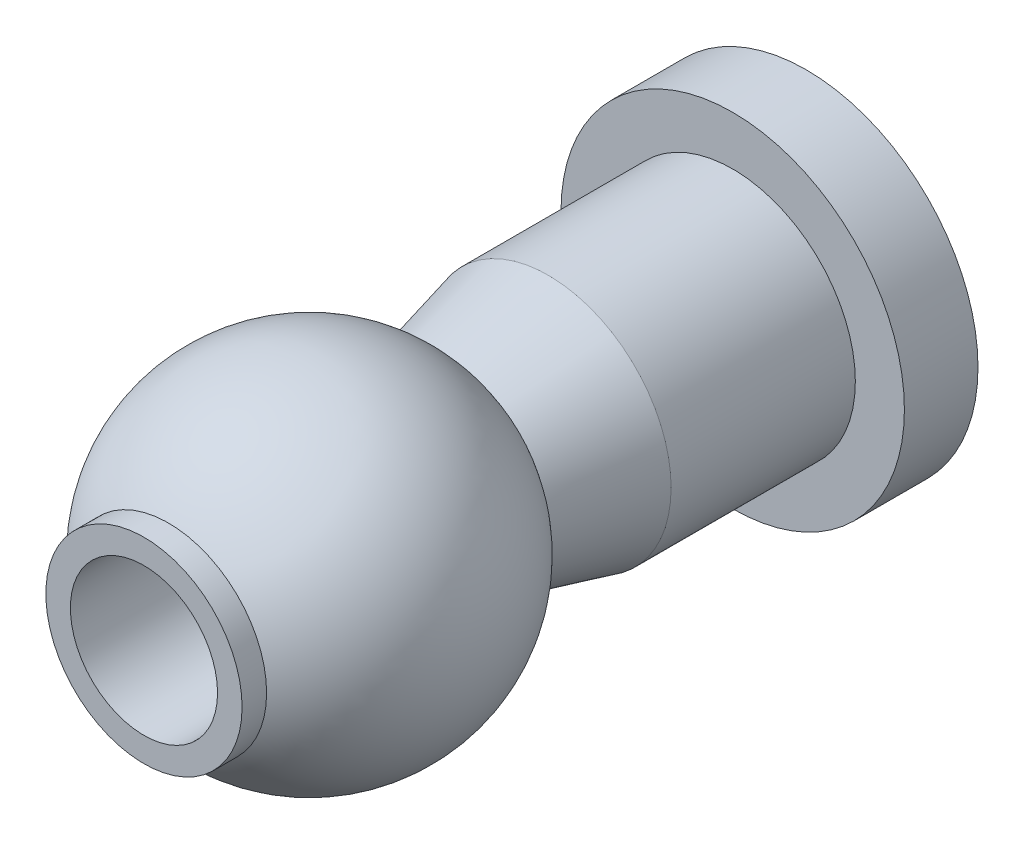
ISO-10303-21;
HEADER;
FILE_DESCRIPTION(('STEP AP214'),'2;1');
FILE_NAME('part.step','',(''),(''),'','','');
FILE_SCHEMA(('AUTOMOTIVE_DESIGN { 1 0 10303 214 1 1 1 1 }'));
ENDSEC;
DATA;
#1=APPLICATION_CONTEXT('core data for automotive mechanical design processes');
#2=APPLICATION_PROTOCOL_DEFINITION('international standard','automotive_design',2000,#1);
#3=PRODUCT_CONTEXT('',#1,'mechanical');
#4=PRODUCT('Part','Part','',(#3));
#5=PRODUCT_RELATED_PRODUCT_CATEGORY('part','',(#4));
#6=PRODUCT_DEFINITION_FORMATION('','',#4);
#7=PRODUCT_DEFINITION_CONTEXT('part definition',#1,'design');
#8=PRODUCT_DEFINITION('design','',#6,#7);
#9=PRODUCT_DEFINITION_SHAPE('','',#8);
#10=(LENGTH_UNIT() NAMED_UNIT(*) SI_UNIT(.MILLI.,.METRE.));
#11=(NAMED_UNIT(*) PLANE_ANGLE_UNIT() SI_UNIT($,.RADIAN.));
#12=(NAMED_UNIT(*) SI_UNIT($,.STERADIAN.) SOLID_ANGLE_UNIT());
#13=UNCERTAINTY_MEASURE_WITH_UNIT(LENGTH_MEASURE(1.E-05),#10,'distance_accuracy_value','');
#14=(GEOMETRIC_REPRESENTATION_CONTEXT(3) GLOBAL_UNCERTAINTY_ASSIGNED_CONTEXT((#13)) GLOBAL_UNIT_ASSIGNED_CONTEXT((#10,
#11,#12)) REPRESENTATION_CONTEXT('',''));
#15=CARTESIAN_POINT('',(0.,0.,0.));
#16=DIRECTION('',(0.,0.,1.));
#17=DIRECTION('',(1.,0.,0.));
#18=AXIS2_PLACEMENT_3D('',#15,#16,#17);
#19=CARTESIAN_POINT('',(0.,0.,-3.37228132326901));
#20=DIRECTION('',(0.,0.,1.));
#21=DIRECTION('',(0.,1.,0.));
#22=AXIS2_PLACEMENT_3D('',#19,#20,#21);
#23=SPHERICAL_SURFACE('',#22,3.5);
#24=CARTESIAN_POINT('',(0.,0.,-0.5));
#25=DIRECTION('',(0.,0.,1.));
#26=DIRECTION('',(1.,0.,0.));
#27=AXIS2_PLACEMENT_3D('',#24,#25,#26);
#28=CIRCLE('',#27,2.);
#29=CARTESIAN_POINT('',(2.,0.,-0.5));
#30=VERTEX_POINT('',#29);
#31=EDGE_CURVE('E10',#30,#30,#28,.T.);
#32=ORIENTED_EDGE('',*,*,#31,.F.);
#33=EDGE_LOOP('',(#32));
#34=FACE_BOUND('',#33,.T.);
#35=CARTESIAN_POINT('',(0.,0.,-6.24456264653803));
#36=DIRECTION('',(0.,0.,1.));
#37=DIRECTION('',(1.,0.,0.));
#38=AXIS2_PLACEMENT_3D('',#35,#36,#37);
#39=CIRCLE('',#38,2.);
#40=CARTESIAN_POINT('',(2.,0.,-6.24456264653803));
#41=VERTEX_POINT('',#40);
#42=EDGE_CURVE('E61',#41,#41,#39,.T.);
#43=ORIENTED_EDGE('',*,*,#42,.T.);
#44=EDGE_LOOP('',(#43));
#45=FACE_BOUND('',#44,.T.);
#46=ADVANCED_FACE('F30',(#34,#45),#23,.T.);
#47=CARTESIAN_POINT('',(0.,0.,0.));
#48=DIRECTION('',(0.,0.,1.));
#49=DIRECTION('',(1.,0.,0.));
#50=AXIS2_PLACEMENT_3D('',#47,#48,#49);
#51=CYLINDRICAL_SURFACE('',#50,2.);
#52=CARTESIAN_POINT('',(0.,0.,0.));
#53=DIRECTION('',(0.,0.,1.));
#54=DIRECTION('',(1.,0.,0.));
#55=AXIS2_PLACEMENT_3D('',#52,#53,#54);
#56=CIRCLE('',#55,2.);
#57=CARTESIAN_POINT('',(2.,0.,0.));
#58=VERTEX_POINT('',#57);
#59=EDGE_CURVE('E36',#58,#58,#56,.T.);
#60=ORIENTED_EDGE('',*,*,#59,.F.);
#61=EDGE_LOOP('',(#60));
#62=FACE_BOUND('',#61,.T.);
#63=ORIENTED_EDGE('',*,*,#31,.T.);
#64=EDGE_LOOP('',(#63));
#65=FACE_BOUND('',#64,.T.);
#66=ADVANCED_FACE('F104',(#62,#65),#51,.T.);
#67=CARTESIAN_POINT('',(0.,1.5,0.));
#68=DIRECTION('',(0.,0.,-1.));
#69=DIRECTION('',(-1.,0.,0.));
#70=AXIS2_PLACEMENT_3D('',#67,#68,#69);
#71=PLANE('',#70);
#72=CARTESIAN_POINT('',(0.,0.,0.));
#73=DIRECTION('',(0.,0.,1.));
#74=DIRECTION('',(1.,0.,0.));
#75=AXIS2_PLACEMENT_3D('',#72,#73,#74);
#76=CIRCLE('',#75,1.5);
#77=CARTESIAN_POINT('',(1.5,0.,0.));
#78=VERTEX_POINT('',#77);
#79=EDGE_CURVE('E40',#78,#78,#76,.T.);
#80=ORIENTED_EDGE('',*,*,#79,.F.);
#81=EDGE_LOOP('',(#80));
#82=FACE_BOUND('',#81,.T.);
#83=ORIENTED_EDGE('',*,*,#59,.T.);
#84=EDGE_LOOP('',(#83));
#85=FACE_BOUND('',#84,.T.);
#86=ADVANCED_FACE('F99',(#82,#85),#71,.F.);
#87=CARTESIAN_POINT('',(0.,0.,0.));
#88=DIRECTION('',(0.,0.,1.));
#89=DIRECTION('',(1.,0.,0.));
#90=AXIS2_PLACEMENT_3D('',#87,#88,#89);
#91=CYLINDRICAL_SURFACE('',#90,1.5);
#92=CARTESIAN_POINT('',(0.,0.,-13.5));
#93=DIRECTION('',(0.,0.,1.));
#94=DIRECTION('',(1.,0.,0.));
#95=AXIS2_PLACEMENT_3D('',#92,#93,#94);
#96=CIRCLE('',#95,1.5);
#97=CARTESIAN_POINT('',(1.5,0.,-13.5));
#98=VERTEX_POINT('',#97);
#99=EDGE_CURVE('E44',#98,#98,#96,.T.);
#100=ORIENTED_EDGE('',*,*,#99,.F.);
#101=EDGE_LOOP('',(#100));
#102=FACE_BOUND('',#101,.T.);
#103=ORIENTED_EDGE('',*,*,#79,.T.);
#104=EDGE_LOOP('',(#103));
#105=FACE_BOUND('',#104,.T.);
#106=ADVANCED_FACE('F93',(#102,#105),#91,.F.);
#107=CARTESIAN_POINT('',(0.,3.5,-13.5));
#108=DIRECTION('',(0.,0.,1.));
#109=DIRECTION('',(1.,0.,0.));
#110=AXIS2_PLACEMENT_3D('',#107,#108,#109);
#111=PLANE('',#110);
#112=CARTESIAN_POINT('',(0.,0.,-13.5));
#113=DIRECTION('',(0.,0.,1.));
#114=DIRECTION('',(1.,0.,0.));
#115=AXIS2_PLACEMENT_3D('',#112,#113,#114);
#116=CIRCLE('',#115,3.5);
#117=CARTESIAN_POINT('',(3.5,0.,-13.5));
#118=VERTEX_POINT('',#117);
#119=EDGE_CURVE('E49',#118,#118,#116,.T.);
#120=ORIENTED_EDGE('',*,*,#119,.F.);
#121=EDGE_LOOP('',(#120));
#122=FACE_BOUND('',#121,.T.);
#123=ORIENTED_EDGE('',*,*,#99,.T.);
#124=EDGE_LOOP('',(#123));
#125=FACE_BOUND('',#124,.T.);
#126=ADVANCED_FACE('F87',(#122,#125),#111,.F.);
#127=CARTESIAN_POINT('',(0.,0.,0.));
#128=DIRECTION('',(0.,0.,1.));
#129=DIRECTION('',(1.,0.,0.));
#130=AXIS2_PLACEMENT_3D('',#127,#128,#129);
#131=CYLINDRICAL_SURFACE('',#130,3.5);
#132=CARTESIAN_POINT('',(0.,0.,-12.));
#133=DIRECTION('',(0.,0.,1.));
#134=DIRECTION('',(1.,0.,0.));
#135=AXIS2_PLACEMENT_3D('',#132,#133,#134);
#136=CIRCLE('',#135,3.5);
#137=CARTESIAN_POINT('',(3.5,0.,-12.));
#138=VERTEX_POINT('',#137);
#139=EDGE_CURVE('E52',#138,#138,#136,.T.);
#140=ORIENTED_EDGE('',*,*,#139,.F.);
#141=EDGE_LOOP('',(#140));
#142=FACE_BOUND('',#141,.T.);
#143=ORIENTED_EDGE('',*,*,#119,.T.);
#144=EDGE_LOOP('',(#143));
#145=FACE_BOUND('',#144,.T.);
#146=ADVANCED_FACE('F81',(#142,#145),#131,.T.);
#147=CARTESIAN_POINT('',(0.,2.5,-12.));
#148=DIRECTION('',(0.,0.,-1.));
#149=DIRECTION('',(-1.,0.,0.));
#150=AXIS2_PLACEMENT_3D('',#147,#148,#149);
#151=PLANE('',#150);
#152=CARTESIAN_POINT('',(0.,0.,-12.));
#153=DIRECTION('',(0.,0.,1.));
#154=DIRECTION('',(1.,0.,0.));
#155=AXIS2_PLACEMENT_3D('',#152,#153,#154);
#156=CIRCLE('',#155,2.5);
#157=CARTESIAN_POINT('',(2.5,0.,-12.));
#158=VERTEX_POINT('',#157);
#159=EDGE_CURVE('E55',#158,#158,#156,.T.);
#160=ORIENTED_EDGE('',*,*,#159,.F.);
#161=EDGE_LOOP('',(#160));
#162=FACE_BOUND('',#161,.T.);
#163=ORIENTED_EDGE('',*,*,#139,.T.);
#164=EDGE_LOOP('',(#163));
#165=FACE_BOUND('',#164,.T.);
#166=ADVANCED_FACE('F75',(#162,#165),#151,.F.);
#167=CARTESIAN_POINT('',(0.,0.,0.));
#168=DIRECTION('',(0.,0.,1.));
#169=DIRECTION('',(1.,0.,0.));
#170=AXIS2_PLACEMENT_3D('',#167,#168,#169);
#171=CYLINDRICAL_SURFACE('',#170,2.5);
#172=CARTESIAN_POINT('',(0.,0.,-8.24456264653803));
#173=DIRECTION('',(0.,0.,1.));
#174=DIRECTION('',(1.,0.,0.));
#175=AXIS2_PLACEMENT_3D('',#172,#173,#174);
#176=CIRCLE('',#175,2.5);
#177=CARTESIAN_POINT('',(2.5,0.,-8.24456264653803));
#178=VERTEX_POINT('',#177);
#179=EDGE_CURVE('E58',#178,#178,#176,.T.);
#180=ORIENTED_EDGE('',*,*,#179,.F.);
#181=EDGE_LOOP('',(#180));
#182=FACE_BOUND('',#181,.T.);
#183=ORIENTED_EDGE('',*,*,#159,.T.);
#184=EDGE_LOOP('',(#183));
#185=FACE_BOUND('',#184,.T.);
#186=ADVANCED_FACE('F69',(#182,#185),#171,.T.);
#187=CARTESIAN_POINT('',(0.,0.,-8.24456264653803));
#188=DIRECTION('',(0.,0.,-1.));
#189=DIRECTION('',(-1.,0.,0.));
#190=AXIS2_PLACEMENT_3D('',#187,#188,#189);
#191=CONICAL_SURFACE('',#190,2.5,0.244978663126864);
#192=ORIENTED_EDGE('',*,*,#42,.F.);
#193=EDGE_LOOP('',(#192));
#194=FACE_BOUND('',#193,.T.);
#195=ORIENTED_EDGE('',*,*,#179,.T.);
#196=EDGE_LOOP('',(#195));
#197=FACE_BOUND('',#196,.T.);
#198=ADVANCED_FACE('F66',(#194,#197),#191,.T.);
#199=CLOSED_SHELL('',(#46,#66,#86,#106,#126,#146,#166,#186,#198));
#200=MANIFOLD_SOLID_BREP('B2',#199);
#201=ADVANCED_BREP_SHAPE_REPRESENTATION('',(#18,#200),#14);
#202=SHAPE_DEFINITION_REPRESENTATION(#9,#201);
ENDSEC;
END-ISO-10303-21;
